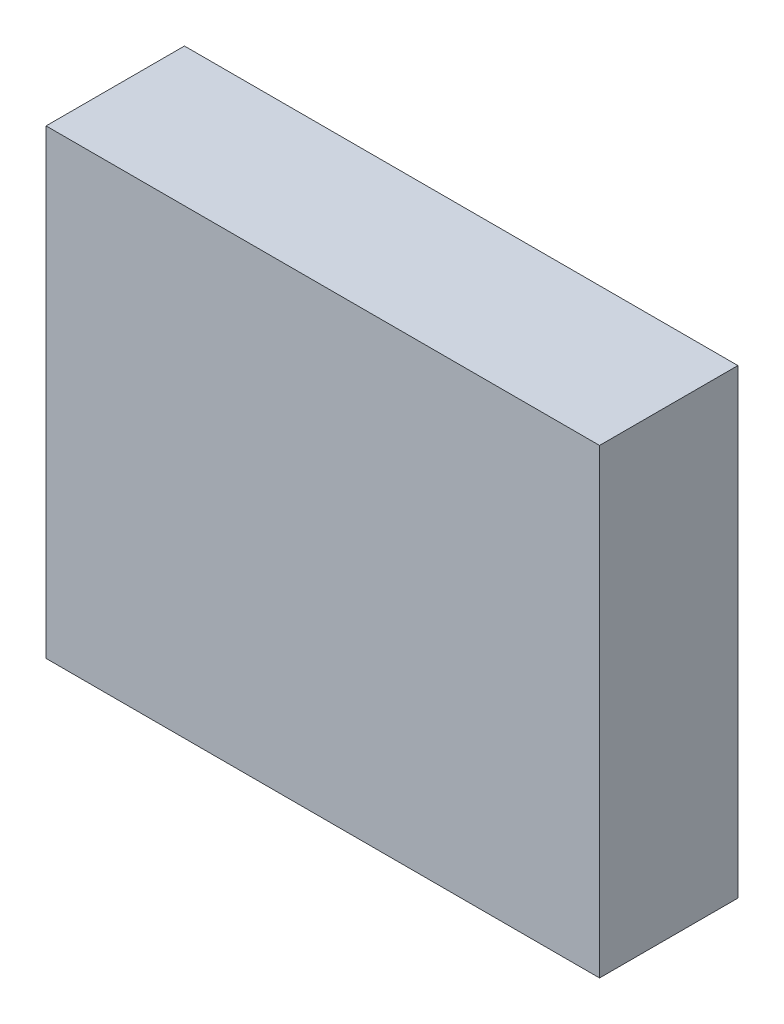
ISO-10303-21;
HEADER;
FILE_DESCRIPTION(('STEP AP214'),'2;1');
FILE_NAME('part.step','',(''),(''),'','','');
FILE_SCHEMA(('AUTOMOTIVE_DESIGN { 1 0 10303 214 1 1 1 1 }'));
ENDSEC;
DATA;
#1=APPLICATION_CONTEXT('core data for automotive mechanical design processes');
#2=APPLICATION_PROTOCOL_DEFINITION('international standard','automotive_design',2000,#1);
#3=PRODUCT_CONTEXT('',#1,'mechanical');
#4=PRODUCT('Part','Part','',(#3));
#5=PRODUCT_RELATED_PRODUCT_CATEGORY('part','',(#4));
#6=PRODUCT_DEFINITION_FORMATION('','',#4);
#7=PRODUCT_DEFINITION_CONTEXT('part definition',#1,'design');
#8=PRODUCT_DEFINITION('design','',#6,#7);
#9=PRODUCT_DEFINITION_SHAPE('','',#8);
#10=(LENGTH_UNIT() NAMED_UNIT(*) SI_UNIT(.MILLI.,.METRE.));
#11=(NAMED_UNIT(*) PLANE_ANGLE_UNIT() SI_UNIT($,.RADIAN.));
#12=(NAMED_UNIT(*) SI_UNIT($,.STERADIAN.) SOLID_ANGLE_UNIT());
#13=UNCERTAINTY_MEASURE_WITH_UNIT(LENGTH_MEASURE(1.E-05),#10,'distance_accuracy_value','');
#14=(GEOMETRIC_REPRESENTATION_CONTEXT(3) GLOBAL_UNCERTAINTY_ASSIGNED_CONTEXT((#13)) GLOBAL_UNIT_ASSIGNED_CONTEXT((#10,
#11,#12)) REPRESENTATION_CONTEXT('',''));
#15=CARTESIAN_POINT('',(0.,0.,0.));
#16=DIRECTION('',(0.,0.,1.));
#17=DIRECTION('',(1.,0.,0.));
#18=AXIS2_PLACEMENT_3D('',#15,#16,#17);
#19=CARTESIAN_POINT('',(6.,-5.,3.));
#20=DIRECTION('',(-1.,0.,0.));
#21=DIRECTION('',(0.,0.,1.));
#22=AXIS2_PLACEMENT_3D('',#19,#20,#21);
#23=PLANE('',#22);
#24=DIRECTION('',(0.,1.,0.));
#25=VECTOR('',#24,1.);
#26=CARTESIAN_POINT('',(6.,-5.,0.));
#27=LINE('',#26,#25);
#28=CARTESIAN_POINT('',(6.,-5.,0.));
#29=VERTEX_POINT('',#28);
#30=CARTESIAN_POINT('',(6.,5.,0.));
#31=VERTEX_POINT('',#30);
#32=EDGE_CURVE('E102',#29,#31,#27,.T.);
#33=ORIENTED_EDGE('',*,*,#32,.T.);
#34=DIRECTION('',(0.,0.,-1.));
#35=VECTOR('',#34,1.);
#36=CARTESIAN_POINT('',(6.,5.,3.));
#37=LINE('',#36,#35);
#38=CARTESIAN_POINT('',(6.,5.,3.));
#39=VERTEX_POINT('',#38);
#40=EDGE_CURVE('E11',#39,#31,#37,.T.);
#41=ORIENTED_EDGE('',*,*,#40,.F.);
#42=DIRECTION('',(0.,1.,0.));
#43=VECTOR('',#42,1.);
#44=CARTESIAN_POINT('',(6.,-5.,3.));
#45=LINE('',#44,#43);
#46=CARTESIAN_POINT('',(6.,-5.,3.));
#47=VERTEX_POINT('',#46);
#48=EDGE_CURVE('E90',#47,#39,#45,.T.);
#49=ORIENTED_EDGE('',*,*,#48,.F.);
#50=DIRECTION('',(0.,0.,-1.));
#51=VECTOR('',#50,1.);
#52=CARTESIAN_POINT('',(6.,-5.,3.));
#53=LINE('',#52,#51);
#54=EDGE_CURVE('E98',#47,#29,#53,.T.);
#55=ORIENTED_EDGE('',*,*,#54,.T.);
#56=EDGE_LOOP('',(#33,#41,#49,#55));
#57=FACE_BOUND('',#56,.T.);
#58=ADVANCED_FACE('F39',(#57),#23,.F.);
#59=CARTESIAN_POINT('',(-6.,5.,3.));
#60=DIRECTION('',(0.,-1.,0.));
#61=DIRECTION('',(0.,0.,-1.));
#62=AXIS2_PLACEMENT_3D('',#59,#60,#61);
#63=PLANE('',#62);
#64=DIRECTION('',(-1.,0.,0.));
#65=VECTOR('',#64,1.);
#66=CARTESIAN_POINT('',(-6.,5.,0.));
#67=LINE('',#66,#65);
#68=CARTESIAN_POINT('',(-6.,5.,0.));
#69=VERTEX_POINT('',#68);
#70=EDGE_CURVE('E94',#31,#69,#67,.T.);
#71=ORIENTED_EDGE('',*,*,#70,.T.);
#72=DIRECTION('',(0.,0.,-1.));
#73=VECTOR('',#72,1.);
#74=CARTESIAN_POINT('',(-6.,5.,3.));
#75=LINE('',#74,#73);
#76=CARTESIAN_POINT('',(-6.,5.,3.));
#77=VERTEX_POINT('',#76);
#78=EDGE_CURVE('E47',#77,#69,#75,.T.);
#79=ORIENTED_EDGE('',*,*,#78,.F.);
#80=DIRECTION('',(-1.,0.,0.));
#81=VECTOR('',#80,1.);
#82=CARTESIAN_POINT('',(-6.,5.,3.));
#83=LINE('',#82,#81);
#84=EDGE_CURVE('E85',#39,#77,#83,.T.);
#85=ORIENTED_EDGE('',*,*,#84,.F.);
#86=ORIENTED_EDGE('',*,*,#40,.T.);
#87=EDGE_LOOP('',(#71,#79,#85,#86));
#88=FACE_BOUND('',#87,.T.);
#89=ADVANCED_FACE('F93',(#88),#63,.F.);
#90=CARTESIAN_POINT('',(-6.,-5.,3.));
#91=DIRECTION('',(1.,0.,0.));
#92=DIRECTION('',(0.,0.,-1.));
#93=AXIS2_PLACEMENT_3D('',#90,#91,#92);
#94=PLANE('',#93);
#95=DIRECTION('',(0.,-1.,0.));
#96=VECTOR('',#95,1.);
#97=CARTESIAN_POINT('',(-6.,-5.,0.));
#98=LINE('',#97,#96);
#99=CARTESIAN_POINT('',(-6.,-5.,0.));
#100=VERTEX_POINT('',#99);
#101=EDGE_CURVE('E72',#69,#100,#98,.T.);
#102=ORIENTED_EDGE('',*,*,#101,.T.);
#103=DIRECTION('',(0.,0.,-1.));
#104=VECTOR('',#103,1.);
#105=CARTESIAN_POINT('',(-6.,-5.,3.));
#106=LINE('',#105,#104);
#107=CARTESIAN_POINT('',(-6.,-5.,3.));
#108=VERTEX_POINT('',#107);
#109=EDGE_CURVE('E95',#108,#100,#106,.T.);
#110=ORIENTED_EDGE('',*,*,#109,.F.);
#111=DIRECTION('',(0.,-1.,0.));
#112=VECTOR('',#111,1.);
#113=CARTESIAN_POINT('',(-6.,-5.,3.));
#114=LINE('',#113,#112);
#115=EDGE_CURVE('E88',#77,#108,#114,.T.);
#116=ORIENTED_EDGE('',*,*,#115,.F.);
#117=ORIENTED_EDGE('',*,*,#78,.T.);
#118=EDGE_LOOP('',(#102,#110,#116,#117));
#119=FACE_BOUND('',#118,.T.);
#120=ADVANCED_FACE('F96',(#119),#94,.F.);
#121=CARTESIAN_POINT('',(-6.,-5.,3.));
#122=DIRECTION('',(0.,1.,0.));
#123=DIRECTION('',(0.,0.,1.));
#124=AXIS2_PLACEMENT_3D('',#121,#122,#123);
#125=PLANE('',#124);
#126=DIRECTION('',(1.,0.,0.));
#127=VECTOR('',#126,1.);
#128=CARTESIAN_POINT('',(-6.,-5.,0.));
#129=LINE('',#128,#127);
#130=EDGE_CURVE('E78',#100,#29,#129,.T.);
#131=ORIENTED_EDGE('',*,*,#130,.T.);
#132=ORIENTED_EDGE('',*,*,#54,.F.);
#133=DIRECTION('',(1.,0.,0.));
#134=VECTOR('',#133,1.);
#135=CARTESIAN_POINT('',(-6.,-5.,3.));
#136=LINE('',#135,#134);
#137=EDGE_CURVE('E55',#108,#47,#136,.T.);
#138=ORIENTED_EDGE('',*,*,#137,.F.);
#139=ORIENTED_EDGE('',*,*,#109,.T.);
#140=EDGE_LOOP('',(#131,#132,#138,#139));
#141=FACE_BOUND('',#140,.T.);
#142=ADVANCED_FACE('F109',(#141),#125,.F.);
#143=CARTESIAN_POINT('',(0.,0.,3.));
#144=DIRECTION('',(0.,0.,-1.));
#145=DIRECTION('',(-1.,0.,0.));
#146=AXIS2_PLACEMENT_3D('',#143,#144,#145);
#147=PLANE('',#146);
#148=ORIENTED_EDGE('',*,*,#48,.T.);
#149=ORIENTED_EDGE('',*,*,#84,.T.);
#150=ORIENTED_EDGE('',*,*,#115,.T.);
#151=ORIENTED_EDGE('',*,*,#137,.T.);
#152=EDGE_LOOP('',(#148,#149,#150,#151));
#153=FACE_BOUND('',#152,.T.);
#154=ADVANCED_FACE('F86',(#153),#147,.F.);
#155=CARTESIAN_POINT('',(0.,0.,0.));
#156=DIRECTION('',(0.,0.,-1.));
#157=DIRECTION('',(-1.,0.,0.));
#158=AXIS2_PLACEMENT_3D('',#155,#156,#157);
#159=PLANE('',#158);
#160=ORIENTED_EDGE('',*,*,#32,.F.);
#161=ORIENTED_EDGE('',*,*,#130,.F.);
#162=ORIENTED_EDGE('',*,*,#101,.F.);
#163=ORIENTED_EDGE('',*,*,#70,.F.);
#164=EDGE_LOOP('',(#160,#161,#162,#163));
#165=FACE_BOUND('',#164,.T.);
#166=ADVANCED_FACE('F112',(#165),#159,.T.);
#167=CLOSED_SHELL('',(#58,#89,#120,#142,#154,#166));
#168=MANIFOLD_SOLID_BREP('B2',#167);
#169=ADVANCED_BREP_SHAPE_REPRESENTATION('',(#18,#168),#14);
#170=SHAPE_DEFINITION_REPRESENTATION(#9,#169);
ENDSEC;
END-ISO-10303-21;
